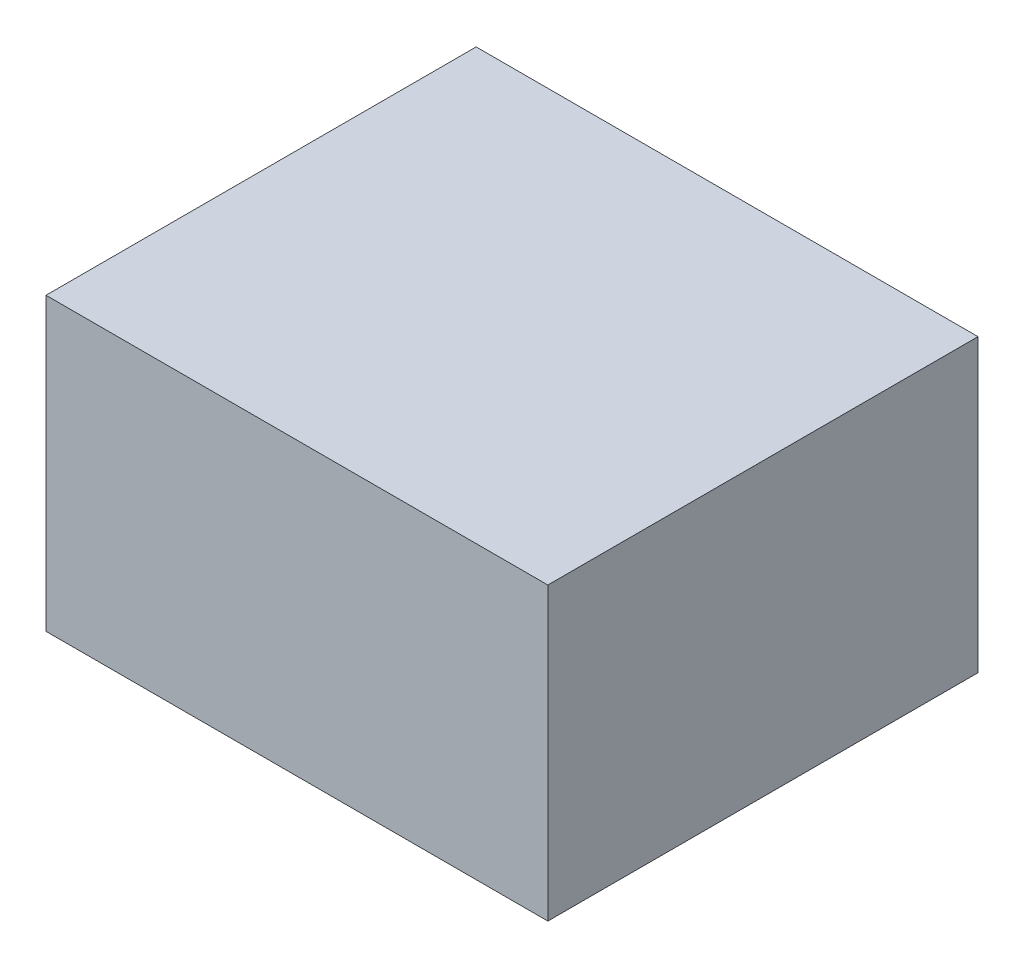
ISO-10303-21;
HEADER;
FILE_DESCRIPTION(('STEP AP214'),'2;1');
FILE_NAME('part.step','',(''),(''),'','','');
FILE_SCHEMA(('AUTOMOTIVE_DESIGN { 1 0 10303 214 1 1 1 1 }'));
ENDSEC;
DATA;
#1=APPLICATION_CONTEXT('core data for automotive mechanical design processes');
#2=APPLICATION_PROTOCOL_DEFINITION('international standard','automotive_design',2000,#1);
#3=PRODUCT_CONTEXT('',#1,'mechanical');
#4=PRODUCT('Part','Part','',(#3));
#5=PRODUCT_RELATED_PRODUCT_CATEGORY('part','',(#4));
#6=PRODUCT_DEFINITION_FORMATION('','',#4);
#7=PRODUCT_DEFINITION_CONTEXT('part definition',#1,'design');
#8=PRODUCT_DEFINITION('design','',#6,#7);
#9=PRODUCT_DEFINITION_SHAPE('','',#8);
#10=(LENGTH_UNIT() NAMED_UNIT(*) SI_UNIT(.MILLI.,.METRE.));
#11=(NAMED_UNIT(*) PLANE_ANGLE_UNIT() SI_UNIT($,.RADIAN.));
#12=(NAMED_UNIT(*) SI_UNIT($,.STERADIAN.) SOLID_ANGLE_UNIT());
#13=UNCERTAINTY_MEASURE_WITH_UNIT(LENGTH_MEASURE(1.E-05),#10,'distance_accuracy_value','');
#14=(GEOMETRIC_REPRESENTATION_CONTEXT(3) GLOBAL_UNCERTAINTY_ASSIGNED_CONTEXT((#13)) GLOBAL_UNIT_ASSIGNED_CONTEXT((#10,
#11,#12)) REPRESENTATION_CONTEXT('',''));
#15=CARTESIAN_POINT('',(0.,0.,0.));
#16=DIRECTION('',(0.,0.,1.));
#17=DIRECTION('',(1.,0.,0.));
#18=AXIS2_PLACEMENT_3D('',#15,#16,#17);
#19=CARTESIAN_POINT('',(-0.5,0.475,-0.725));
#20=DIRECTION('',(-1.,0.,0.));
#21=DIRECTION('',(0.,0.,1.));
#22=AXIS2_PLACEMENT_3D('',#19,#20,#21);
#23=PLANE('',#22);
#24=DIRECTION('',(0.,0.,-1.));
#25=VECTOR('',#24,1.);
#26=CARTESIAN_POINT('',(-0.5,0.272,-0.725));
#27=LINE('',#26,#25);
#28=CARTESIAN_POINT('',(-0.5,0.272,-0.725));
#29=VERTEX_POINT('',#28);
#30=CARTESIAN_POINT('',(-0.5,0.272,-1.025));
#31=VERTEX_POINT('',#30);
#32=EDGE_CURVE('E11',#29,#31,#27,.T.);
#33=ORIENTED_EDGE('',*,*,#32,.T.);
#34=DIRECTION('',(0.,-1.,0.));
#35=VECTOR('',#34,1.);
#36=CARTESIAN_POINT('',(-0.5,0.475,-1.025));
#37=LINE('',#36,#35);
#38=CARTESIAN_POINT('',(-0.5,0.475,-1.025));
#39=VERTEX_POINT('',#38);
#40=EDGE_CURVE('E24',#39,#31,#37,.T.);
#41=ORIENTED_EDGE('',*,*,#40,.F.);
#42=DIRECTION('',(0.,0.,-1.));
#43=VECTOR('',#42,1.);
#44=CARTESIAN_POINT('',(-0.5,0.475,-0.725));
#45=LINE('',#44,#43);
#46=CARTESIAN_POINT('',(-0.5,0.475,-0.725));
#47=VERTEX_POINT('',#46);
#48=EDGE_CURVE('E88',#47,#39,#45,.T.);
#49=ORIENTED_EDGE('',*,*,#48,.F.);
#50=DIRECTION('',(0.,-1.,0.));
#51=VECTOR('',#50,1.);
#52=CARTESIAN_POINT('',(-0.5,0.475,-0.725));
#53=LINE('',#52,#51);
#54=EDGE_CURVE('E77',#47,#29,#53,.T.);
#55=ORIENTED_EDGE('',*,*,#54,.T.);
#56=EDGE_LOOP('',(#33,#41,#49,#55));
#57=FACE_BOUND('',#56,.T.);
#58=ADVANCED_FACE('F17',(#57),#23,.F.);
#59=CARTESIAN_POINT('',(-0.5,0.475,-1.025));
#60=DIRECTION('',(0.,0.,1.));
#61=DIRECTION('',(1.,0.,0.));
#62=AXIS2_PLACEMENT_3D('',#59,#60,#61);
#63=PLANE('',#62);
#64=DIRECTION('',(-1.,0.,0.));
#65=VECTOR('',#64,1.);
#66=CARTESIAN_POINT('',(-0.5,0.272,-1.025));
#67=LINE('',#66,#65);
#68=CARTESIAN_POINT('',(-0.850000000000001,0.272,-1.025));
#69=VERTEX_POINT('',#68);
#70=EDGE_CURVE('E85',#31,#69,#67,.T.);
#71=ORIENTED_EDGE('',*,*,#70,.T.);
#72=DIRECTION('',(0.,-1.,0.));
#73=VECTOR('',#72,1.);
#74=CARTESIAN_POINT('',(-0.850000000000001,0.475,-1.025));
#75=LINE('',#74,#73);
#76=CARTESIAN_POINT('',(-0.850000000000001,0.475,-1.025));
#77=VERTEX_POINT('',#76);
#78=EDGE_CURVE('E83',#77,#69,#75,.T.);
#79=ORIENTED_EDGE('',*,*,#78,.F.);
#80=DIRECTION('',(-1.,0.,0.));
#81=VECTOR('',#80,1.);
#82=CARTESIAN_POINT('',(-0.5,0.475,-1.025));
#83=LINE('',#82,#81);
#84=EDGE_CURVE('E72',#39,#77,#83,.T.);
#85=ORIENTED_EDGE('',*,*,#84,.F.);
#86=ORIENTED_EDGE('',*,*,#40,.T.);
#87=EDGE_LOOP('',(#71,#79,#85,#86));
#88=FACE_BOUND('',#87,.T.);
#89=ADVANCED_FACE('F90',(#88),#63,.F.);
#90=CARTESIAN_POINT('',(-0.850000000000001,0.475,-1.025));
#91=DIRECTION('',(1.,0.,0.));
#92=DIRECTION('',(0.,0.,-1.));
#93=AXIS2_PLACEMENT_3D('',#90,#91,#92);
#94=PLANE('',#93);
#95=DIRECTION('',(0.,0.,1.));
#96=VECTOR('',#95,1.);
#97=CARTESIAN_POINT('',(-0.850000000000001,0.272,-1.025));
#98=LINE('',#97,#96);
#99=CARTESIAN_POINT('',(-0.850000000000001,0.272,-0.725));
#100=VERTEX_POINT('',#99);
#101=EDGE_CURVE('E60',#69,#100,#98,.T.);
#102=ORIENTED_EDGE('',*,*,#101,.T.);
#103=DIRECTION('',(0.,-1.,0.));
#104=VECTOR('',#103,1.);
#105=CARTESIAN_POINT('',(-0.850000000000001,0.475,-0.725));
#106=LINE('',#105,#104);
#107=CARTESIAN_POINT('',(-0.850000000000001,0.475,-0.725));
#108=VERTEX_POINT('',#107);
#109=EDGE_CURVE('E54',#108,#100,#106,.T.);
#110=ORIENTED_EDGE('',*,*,#109,.F.);
#111=DIRECTION('',(0.,0.,1.));
#112=VECTOR('',#111,1.);
#113=CARTESIAN_POINT('',(-0.850000000000001,0.475,-1.025));
#114=LINE('',#113,#112);
#115=EDGE_CURVE('E58',#77,#108,#114,.T.);
#116=ORIENTED_EDGE('',*,*,#115,.F.);
#117=ORIENTED_EDGE('',*,*,#78,.T.);
#118=EDGE_LOOP('',(#102,#110,#116,#117));
#119=FACE_BOUND('',#118,.T.);
#120=ADVANCED_FACE('F56',(#119),#94,.F.);
#121=CARTESIAN_POINT('',(-0.850000000000001,0.475,-0.725));
#122=DIRECTION('',(0.,0.,-1.));
#123=DIRECTION('',(-1.,0.,0.));
#124=AXIS2_PLACEMENT_3D('',#121,#122,#123);
#125=PLANE('',#124);
#126=DIRECTION('',(1.,0.,0.));
#127=VECTOR('',#126,1.);
#128=CARTESIAN_POINT('',(-0.850000000000001,0.272,-0.725));
#129=LINE('',#128,#127);
#130=EDGE_CURVE('E73',#100,#29,#129,.T.);
#131=ORIENTED_EDGE('',*,*,#130,.T.);
#132=ORIENTED_EDGE('',*,*,#54,.F.);
#133=DIRECTION('',(1.,0.,0.));
#134=VECTOR('',#133,1.);
#135=CARTESIAN_POINT('',(-0.850000000000001,0.475,-0.725));
#136=LINE('',#135,#134);
#137=EDGE_CURVE('E70',#108,#47,#136,.T.);
#138=ORIENTED_EDGE('',*,*,#137,.F.);
#139=ORIENTED_EDGE('',*,*,#109,.T.);
#140=EDGE_LOOP('',(#131,#132,#138,#139));
#141=FACE_BOUND('',#140,.T.);
#142=ADVANCED_FACE('F76',(#141),#125,.F.);
#143=CARTESIAN_POINT('',(0.,0.475,0.));
#144=DIRECTION('',(0.,1.,0.));
#145=DIRECTION('',(0.,0.,1.));
#146=AXIS2_PLACEMENT_3D('',#143,#144,#145);
#147=PLANE('',#146);
#148=ORIENTED_EDGE('',*,*,#48,.T.);
#149=ORIENTED_EDGE('',*,*,#84,.T.);
#150=ORIENTED_EDGE('',*,*,#115,.T.);
#151=ORIENTED_EDGE('',*,*,#137,.T.);
#152=EDGE_LOOP('',(#148,#149,#150,#151));
#153=FACE_BOUND('',#152,.T.);
#154=ADVANCED_FACE('F69',(#153),#147,.T.);
#155=CARTESIAN_POINT('',(0.,0.272,0.));
#156=DIRECTION('',(0.,1.,0.));
#157=DIRECTION('',(0.,0.,1.));
#158=AXIS2_PLACEMENT_3D('',#155,#156,#157);
#159=PLANE('',#158);
#160=ORIENTED_EDGE('',*,*,#32,.F.);
#161=ORIENTED_EDGE('',*,*,#130,.F.);
#162=ORIENTED_EDGE('',*,*,#101,.F.);
#163=ORIENTED_EDGE('',*,*,#70,.F.);
#164=EDGE_LOOP('',(#160,#161,#162,#163));
#165=FACE_BOUND('',#164,.T.);
#166=ADVANCED_FACE('F91',(#165),#159,.F.);
#167=CLOSED_SHELL('',(#58,#89,#120,#142,#154,#166));
#168=MANIFOLD_SOLID_BREP('B1',#167);
#169=ADVANCED_BREP_SHAPE_REPRESENTATION('',(#18,#168),#14);
#170=SHAPE_DEFINITION_REPRESENTATION(#9,#169);
ENDSEC;
END-ISO-10303-21;
